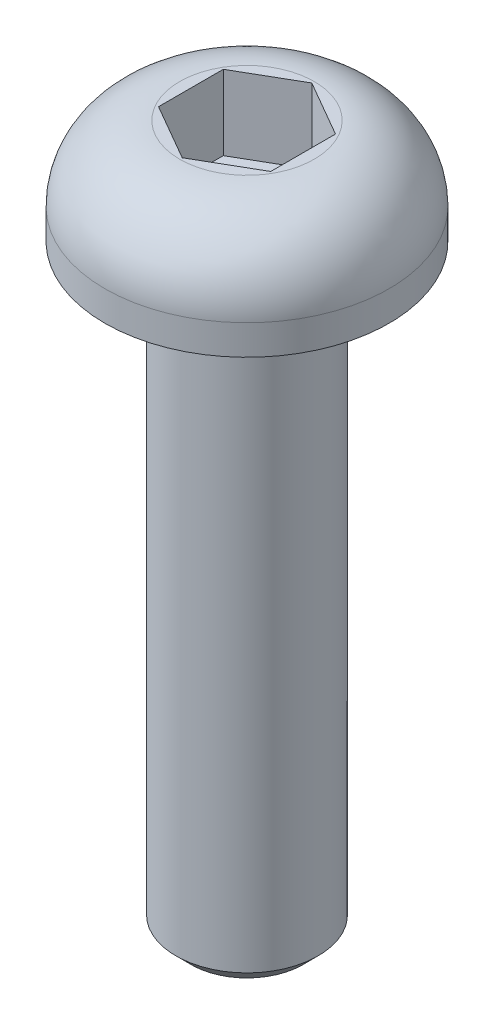
ISO-10303-21;
HEADER;
FILE_DESCRIPTION(('STEP AP214'),'2;1');
FILE_NAME('part.step','',(''),(''),'','','');
FILE_SCHEMA(('AUTOMOTIVE_DESIGN { 1 0 10303 214 1 1 1 1 }'));
ENDSEC;
DATA;
#1=APPLICATION_CONTEXT('core data for automotive mechanical design processes');
#2=APPLICATION_PROTOCOL_DEFINITION('international standard','automotive_design',2000,#1);
#3=PRODUCT_CONTEXT('',#1,'mechanical');
#4=PRODUCT('Part','Part','',(#3));
#5=PRODUCT_RELATED_PRODUCT_CATEGORY('part','',(#4));
#6=PRODUCT_DEFINITION_FORMATION('','',#4);
#7=PRODUCT_DEFINITION_CONTEXT('part definition',#1,'design');
#8=PRODUCT_DEFINITION('design','',#6,#7);
#9=PRODUCT_DEFINITION_SHAPE('','',#8);
#10=(LENGTH_UNIT() NAMED_UNIT(*) SI_UNIT(.MILLI.,.METRE.));
#11=(NAMED_UNIT(*) PLANE_ANGLE_UNIT() SI_UNIT($,.RADIAN.));
#12=(NAMED_UNIT(*) SI_UNIT($,.STERADIAN.) SOLID_ANGLE_UNIT());
#13=UNCERTAINTY_MEASURE_WITH_UNIT(LENGTH_MEASURE(1.E-05),#10,'distance_accuracy_value','');
#14=(GEOMETRIC_REPRESENTATION_CONTEXT(3) GLOBAL_UNCERTAINTY_ASSIGNED_CONTEXT((#13)) GLOBAL_UNIT_ASSIGNED_CONTEXT((#10,
#11,#12)) REPRESENTATION_CONTEXT('',''));
#15=CARTESIAN_POINT('',(0.,0.,0.));
#16=DIRECTION('',(0.,0.,1.));
#17=DIRECTION('',(1.,0.,0.));
#18=AXIS2_PLACEMENT_3D('',#15,#16,#17);
#19=CARTESIAN_POINT('',(0.,1.4,0.));
#20=DIRECTION('',(0.,-1.,0.));
#21=DIRECTION('',(0.,0.,-1.));
#22=AXIS2_PLACEMENT_3D('',#19,#20,#21);
#23=CYLINDRICAL_SURFACE('',#22,1.9);
#24=CARTESIAN_POINT('',(0.,0.4,0.));
#25=DIRECTION('',(0.,1.,0.));
#26=DIRECTION('',(0.,0.,1.));
#27=AXIS2_PLACEMENT_3D('',#24,#25,#26);
#28=CIRCLE('',#27,1.9);
#29=CARTESIAN_POINT('',(0.,0.4,1.9));
#30=VERTEX_POINT('',#29);
#31=EDGE_CURVE('E153',#30,#30,#28,.F.);
#32=ORIENTED_EDGE('',*,*,#31,.T.);
#33=EDGE_LOOP('',(#32));
#34=FACE_BOUND('',#33,.T.);
#35=CARTESIAN_POINT('',(0.,0.,0.));
#36=DIRECTION('',(0.,1.,0.));
#37=DIRECTION('',(0.,0.,1.));
#38=AXIS2_PLACEMENT_3D('',#35,#36,#37);
#39=CIRCLE('',#38,1.9);
#40=CARTESIAN_POINT('',(0.,0.,1.9));
#41=VERTEX_POINT('',#40);
#42=EDGE_CURVE('E142',#41,#41,#39,.T.);
#43=ORIENTED_EDGE('',*,*,#42,.T.);
#44=EDGE_LOOP('',(#43));
#45=FACE_BOUND('',#44,.T.);
#46=ADVANCED_FACE('F39',(#34,#45),#23,.T.);
#47=CARTESIAN_POINT('',(0.,1.4,0.));
#48=DIRECTION('',(0.,1.,0.));
#49=DIRECTION('',(0.,0.,1.));
#50=AXIS2_PLACEMENT_3D('',#47,#48,#49);
#51=PLANE('',#50);
#52=CARTESIAN_POINT('',(0.,1.4,0.));
#53=DIRECTION('',(0.,1.,0.));
#54=DIRECTION('',(0.,0.,1.));
#55=AXIS2_PLACEMENT_3D('',#52,#53,#54);
#56=CIRCLE('',#55,0.9);
#57=CARTESIAN_POINT('',(0.,1.4,0.9));
#58=VERTEX_POINT('',#57);
#59=EDGE_CURVE('E150',#58,#58,#56,.T.);
#60=ORIENTED_EDGE('',*,*,#59,.T.);
#61=EDGE_LOOP('',(#60));
#62=FACE_BOUND('',#61,.T.);
#63=DIRECTION('',(0.866025403784439,0.,0.5));
#64=VECTOR('',#63,1.);
#65=CARTESIAN_POINT('',(-0.75,1.4,0.433012701892219));
#66=LINE('',#65,#64);
#67=CARTESIAN_POINT('',(-0.75,1.4,0.433012701892219));
#68=VERTEX_POINT('',#67);
#69=CARTESIAN_POINT('',(0.,1.4,0.866025403784439));
#70=VERTEX_POINT('',#69);
#71=EDGE_CURVE('E55',#68,#70,#66,.T.);
#72=ORIENTED_EDGE('',*,*,#71,.F.);
#73=DIRECTION('',(0.,0.,1.));
#74=VECTOR('',#73,1.);
#75=CARTESIAN_POINT('',(-0.75,1.4,-0.43301270189222));
#76=LINE('',#75,#74);
#77=CARTESIAN_POINT('',(-0.75,1.4,-0.43301270189222));
#78=VERTEX_POINT('',#77);
#79=EDGE_CURVE('E138',#78,#68,#76,.T.);
#80=ORIENTED_EDGE('',*,*,#79,.F.);
#81=DIRECTION('',(-0.866025403784439,0.,0.5));
#82=VECTOR('',#81,1.);
#83=CARTESIAN_POINT('',(0.,1.4,-0.866025403784439));
#84=LINE('',#83,#82);
#85=CARTESIAN_POINT('',(0.,1.4,-0.866025403784439));
#86=VERTEX_POINT('',#85);
#87=EDGE_CURVE('E136',#86,#78,#84,.T.);
#88=ORIENTED_EDGE('',*,*,#87,.F.);
#89=DIRECTION('',(-0.866025403784439,0.,-0.5));
#90=VECTOR('',#89,1.);
#91=CARTESIAN_POINT('',(0.75,1.4,-0.43301270189222));
#92=LINE('',#91,#90);
#93=CARTESIAN_POINT('',(0.75,1.4,-0.43301270189222));
#94=VERTEX_POINT('',#93);
#95=EDGE_CURVE('E103',#94,#86,#92,.T.);
#96=ORIENTED_EDGE('',*,*,#95,.F.);
#97=DIRECTION('',(0.,0.,-1.));
#98=VECTOR('',#97,1.);
#99=CARTESIAN_POINT('',(0.75,1.4,0.43301270189222));
#100=LINE('',#99,#98);
#101=CARTESIAN_POINT('',(0.75,1.4,0.43301270189222));
#102=VERTEX_POINT('',#101);
#103=EDGE_CURVE('E132',#102,#94,#100,.T.);
#104=ORIENTED_EDGE('',*,*,#103,.F.);
#105=DIRECTION('',(0.866025403784439,0.,-0.5));
#106=VECTOR('',#105,1.);
#107=CARTESIAN_POINT('',(0.,1.4,0.866025403784439));
#108=LINE('',#107,#106);
#109=EDGE_CURVE('E129',#70,#102,#108,.T.);
#110=ORIENTED_EDGE('',*,*,#109,.F.);
#111=EDGE_LOOP('',(#72,#80,#88,#96,#104,#110));
#112=FACE_BOUND('',#111,.T.);
#113=ADVANCED_FACE('F171',(#62,#112),#51,.T.);
#114=CARTESIAN_POINT('',(0.,0.,0.));
#115=DIRECTION('',(0.,1.,0.));
#116=DIRECTION('',(0.,0.,1.));
#117=AXIS2_PLACEMENT_3D('',#114,#115,#116);
#118=PLANE('',#117);
#119=CARTESIAN_POINT('',(0.,0.,0.));
#120=DIRECTION('',(0.,-1.,0.));
#121=DIRECTION('',(0.,0.,-1.));
#122=AXIS2_PLACEMENT_3D('',#119,#120,#121);
#123=CIRCLE('',#122,0.95);
#124=CARTESIAN_POINT('',(0.,0.,-0.95));
#125=VERTEX_POINT('',#124);
#126=EDGE_CURVE('E155',#125,#125,#123,.T.);
#127=ORIENTED_EDGE('',*,*,#126,.F.);
#128=EDGE_LOOP('',(#127));
#129=FACE_BOUND('',#128,.T.);
#130=ORIENTED_EDGE('',*,*,#42,.F.);
#131=EDGE_LOOP('',(#130));
#132=FACE_BOUND('',#131,.T.);
#133=ADVANCED_FACE('F182',(#129,#132),#118,.F.);
#134=CARTESIAN_POINT('',(-0.75,0.4,0.433012701892219));
#135=DIRECTION('',(-0.5,0.,0.866025403784439));
#136=DIRECTION('',(0.866025403784439,0.,0.5));
#137=AXIS2_PLACEMENT_3D('',#134,#135,#136);
#138=PLANE('',#137);
#139=ORIENTED_EDGE('',*,*,#71,.T.);
#140=DIRECTION('',(0.,1.,0.));
#141=VECTOR('',#140,1.);
#142=CARTESIAN_POINT('',(0.,0.4,0.866025403784439));
#143=LINE('',#142,#141);
#144=CARTESIAN_POINT('',(0.,0.4,0.866025403784439));
#145=VERTEX_POINT('',#144);
#146=EDGE_CURVE('E85',#145,#70,#143,.T.);
#147=ORIENTED_EDGE('',*,*,#146,.F.);
#148=DIRECTION('',(0.866025403784439,0.,0.5));
#149=VECTOR('',#148,1.);
#150=CARTESIAN_POINT('',(-0.75,0.4,0.433012701892219));
#151=LINE('',#150,#149);
#152=CARTESIAN_POINT('',(-0.75,0.4,0.433012701892219));
#153=VERTEX_POINT('',#152);
#154=EDGE_CURVE('E140',#153,#145,#151,.T.);
#155=ORIENTED_EDGE('',*,*,#154,.F.);
#156=DIRECTION('',(0.,1.,0.));
#157=VECTOR('',#156,1.);
#158=CARTESIAN_POINT('',(-0.75,0.4,0.433012701892219));
#159=LINE('',#158,#157);
#160=EDGE_CURVE('E63',#153,#68,#159,.T.);
#161=ORIENTED_EDGE('',*,*,#160,.T.);
#162=EDGE_LOOP('',(#139,#147,#155,#161));
#163=FACE_BOUND('',#162,.T.);
#164=ADVANCED_FACE('F175',(#163),#138,.F.);
#165=CARTESIAN_POINT('',(-0.75,0.4,-0.43301270189222));
#166=DIRECTION('',(-1.,0.,0.));
#167=DIRECTION('',(0.,0.,1.));
#168=AXIS2_PLACEMENT_3D('',#165,#166,#167);
#169=PLANE('',#168);
#170=ORIENTED_EDGE('',*,*,#79,.T.);
#171=ORIENTED_EDGE('',*,*,#160,.F.);
#172=DIRECTION('',(0.,0.,1.));
#173=VECTOR('',#172,1.);
#174=CARTESIAN_POINT('',(-0.75,0.4,-0.43301270189222));
#175=LINE('',#174,#173);
#176=CARTESIAN_POINT('',(-0.75,0.4,-0.43301270189222));
#177=VERTEX_POINT('',#176);
#178=EDGE_CURVE('E115',#177,#153,#175,.T.);
#179=ORIENTED_EDGE('',*,*,#178,.F.);
#180=DIRECTION('',(0.,1.,0.));
#181=VECTOR('',#180,1.);
#182=CARTESIAN_POINT('',(-0.75,0.4,-0.43301270189222));
#183=LINE('',#182,#181);
#184=EDGE_CURVE('E107',#177,#78,#183,.T.);
#185=ORIENTED_EDGE('',*,*,#184,.T.);
#186=EDGE_LOOP('',(#170,#171,#179,#185));
#187=FACE_BOUND('',#186,.T.);
#188=ADVANCED_FACE('F173',(#187),#169,.F.);
#189=CARTESIAN_POINT('',(0.,0.4,-0.866025403784439));
#190=DIRECTION('',(-0.5,0.,-0.866025403784439));
#191=DIRECTION('',(-0.866025403784439,0.,0.5));
#192=AXIS2_PLACEMENT_3D('',#189,#190,#191);
#193=PLANE('',#192);
#194=ORIENTED_EDGE('',*,*,#87,.T.);
#195=ORIENTED_EDGE('',*,*,#184,.F.);
#196=DIRECTION('',(-0.866025403784439,0.,0.5));
#197=VECTOR('',#196,1.);
#198=CARTESIAN_POINT('',(0.,0.4,-0.866025403784439));
#199=LINE('',#198,#197);
#200=CARTESIAN_POINT('',(0.,0.4,-0.866025403784439));
#201=VERTEX_POINT('',#200);
#202=EDGE_CURVE('E111',#201,#177,#199,.T.);
#203=ORIENTED_EDGE('',*,*,#202,.F.);
#204=DIRECTION('',(0.,1.,0.));
#205=VECTOR('',#204,1.);
#206=CARTESIAN_POINT('',(0.,0.4,-0.866025403784439));
#207=LINE('',#206,#205);
#208=EDGE_CURVE('E96',#201,#86,#207,.T.);
#209=ORIENTED_EDGE('',*,*,#208,.T.);
#210=EDGE_LOOP('',(#194,#195,#203,#209));
#211=FACE_BOUND('',#210,.T.);
#212=ADVANCED_FACE('F112',(#211),#193,.F.);
#213=CARTESIAN_POINT('',(0.75,0.4,-0.43301270189222));
#214=DIRECTION('',(0.5,0.,-0.866025403784439));
#215=DIRECTION('',(-0.866025403784439,0.,-0.5));
#216=AXIS2_PLACEMENT_3D('',#213,#214,#215);
#217=PLANE('',#216);
#218=ORIENTED_EDGE('',*,*,#95,.T.);
#219=ORIENTED_EDGE('',*,*,#208,.F.);
#220=DIRECTION('',(-0.866025403784439,0.,-0.5));
#221=VECTOR('',#220,1.);
#222=CARTESIAN_POINT('',(0.75,0.4,-0.43301270189222));
#223=LINE('',#222,#221);
#224=CARTESIAN_POINT('',(0.75,0.4,-0.43301270189222));
#225=VERTEX_POINT('',#224);
#226=EDGE_CURVE('E100',#225,#201,#223,.T.);
#227=ORIENTED_EDGE('',*,*,#226,.F.);
#228=DIRECTION('',(0.,1.,0.));
#229=VECTOR('',#228,1.);
#230=CARTESIAN_POINT('',(0.75,0.4,-0.43301270189222));
#231=LINE('',#230,#229);
#232=EDGE_CURVE('E108',#225,#94,#231,.T.);
#233=ORIENTED_EDGE('',*,*,#232,.T.);
#234=EDGE_LOOP('',(#218,#219,#227,#233));
#235=FACE_BOUND('',#234,.T.);
#236=ADVANCED_FACE('F98',(#235),#217,.F.);
#237=CARTESIAN_POINT('',(0.75,0.4,0.43301270189222));
#238=DIRECTION('',(1.,0.,0.));
#239=DIRECTION('',(0.,0.,-1.));
#240=AXIS2_PLACEMENT_3D('',#237,#238,#239);
#241=PLANE('',#240);
#242=ORIENTED_EDGE('',*,*,#103,.T.);
#243=ORIENTED_EDGE('',*,*,#232,.F.);
#244=DIRECTION('',(0.,0.,-1.));
#245=VECTOR('',#244,1.);
#246=CARTESIAN_POINT('',(0.75,0.4,0.43301270189222));
#247=LINE('',#246,#245);
#248=CARTESIAN_POINT('',(0.75,0.4,0.43301270189222));
#249=VERTEX_POINT('',#248);
#250=EDGE_CURVE('E121',#249,#225,#247,.T.);
#251=ORIENTED_EDGE('',*,*,#250,.F.);
#252=DIRECTION('',(0.,1.,0.));
#253=VECTOR('',#252,1.);
#254=CARTESIAN_POINT('',(0.75,0.4,0.43301270189222));
#255=LINE('',#254,#253);
#256=EDGE_CURVE('E145',#249,#102,#255,.T.);
#257=ORIENTED_EDGE('',*,*,#256,.T.);
#258=EDGE_LOOP('',(#242,#243,#251,#257));
#259=FACE_BOUND('',#258,.T.);
#260=ADVANCED_FACE('F169',(#259),#241,.F.);
#261=CARTESIAN_POINT('',(0.,0.4,0.866025403784439));
#262=DIRECTION('',(0.5,0.,0.866025403784439));
#263=DIRECTION('',(0.866025403784439,0.,-0.5));
#264=AXIS2_PLACEMENT_3D('',#261,#262,#263);
#265=PLANE('',#264);
#266=ORIENTED_EDGE('',*,*,#109,.T.);
#267=ORIENTED_EDGE('',*,*,#256,.F.);
#268=DIRECTION('',(0.866025403784439,0.,-0.5));
#269=VECTOR('',#268,1.);
#270=CARTESIAN_POINT('',(0.,0.4,0.866025403784439));
#271=LINE('',#270,#269);
#272=EDGE_CURVE('E123',#145,#249,#271,.T.);
#273=ORIENTED_EDGE('',*,*,#272,.F.);
#274=ORIENTED_EDGE('',*,*,#146,.T.);
#275=EDGE_LOOP('',(#266,#267,#273,#274));
#276=FACE_BOUND('',#275,.T.);
#277=ADVANCED_FACE('F165',(#276),#265,.F.);
#278=CARTESIAN_POINT('',(0.,0.4,0.));
#279=DIRECTION('',(0.,1.,0.));
#280=DIRECTION('',(0.,0.,1.));
#281=AXIS2_PLACEMENT_3D('',#278,#279,#280);
#282=PLANE('',#281);
#283=ORIENTED_EDGE('',*,*,#154,.T.);
#284=ORIENTED_EDGE('',*,*,#272,.T.);
#285=ORIENTED_EDGE('',*,*,#250,.T.);
#286=ORIENTED_EDGE('',*,*,#226,.T.);
#287=ORIENTED_EDGE('',*,*,#202,.T.);
#288=ORIENTED_EDGE('',*,*,#178,.T.);
#289=EDGE_LOOP('',(#283,#284,#285,#286,#287,#288));
#290=FACE_BOUND('',#289,.T.);
#291=ADVANCED_FACE('F118',(#290),#282,.T.);
#292=CARTESIAN_POINT('',(0.,0.4,0.));
#293=DIRECTION('',(0.,1.,0.));
#294=DIRECTION('',(0.,0.,1.));
#295=AXIS2_PLACEMENT_3D('',#292,#293,#294);
#296=DEGENERATE_TOROIDAL_SURFACE('',#295,0.9,1.,.T.);
#297=ORIENTED_EDGE('',*,*,#31,.F.);
#298=EDGE_LOOP('',(#297));
#299=FACE_BOUND('',#298,.T.);
#300=ORIENTED_EDGE('',*,*,#59,.F.);
#301=EDGE_LOOP('',(#300));
#302=FACE_BOUND('',#301,.T.);
#303=ADVANCED_FACE('F195',(#299,#302),#296,.T.);
#304=CARTESIAN_POINT('',(0.,-8.,0.));
#305=DIRECTION('',(0.,1.,0.));
#306=DIRECTION('',(0.,0.,1.));
#307=AXIS2_PLACEMENT_3D('',#304,#305,#306);
#308=CYLINDRICAL_SURFACE('',#307,0.95);
#309=CARTESIAN_POINT('',(0.,-7.8,0.));
#310=DIRECTION('',(0.,-1.,0.));
#311=DIRECTION('',(0.,0.,-1.));
#312=AXIS2_PLACEMENT_3D('',#309,#310,#311);
#313=CIRCLE('',#312,0.95);
#314=CARTESIAN_POINT('',(0.,-7.8,-0.95));
#315=VERTEX_POINT('',#314);
#316=EDGE_CURVE('E11',#315,#315,#313,.F.);
#317=ORIENTED_EDGE('',*,*,#316,.T.);
#318=EDGE_LOOP('',(#317));
#319=FACE_BOUND('',#318,.T.);
#320=ORIENTED_EDGE('',*,*,#126,.T.);
#321=EDGE_LOOP('',(#320));
#322=FACE_BOUND('',#321,.T.);
#323=ADVANCED_FACE('F197',(#319,#322),#308,.T.);
#324=CARTESIAN_POINT('',(0.,-8.,0.));
#325=DIRECTION('',(0.,-1.,0.));
#326=DIRECTION('',(0.,0.,-1.));
#327=AXIS2_PLACEMENT_3D('',#324,#325,#326);
#328=PLANE('',#327);
#329=CARTESIAN_POINT('',(0.,-8.,0.));
#330=DIRECTION('',(0.,-1.,0.));
#331=DIRECTION('',(0.,0.,-1.));
#332=AXIS2_PLACEMENT_3D('',#329,#330,#331);
#333=CIRCLE('',#332,0.750000000000001);
#334=CARTESIAN_POINT('',(0.,-8.,-0.750000000000001));
#335=VERTEX_POINT('',#334);
#336=EDGE_CURVE('E48',#335,#335,#333,.T.);
#337=ORIENTED_EDGE('',*,*,#336,.T.);
#338=EDGE_LOOP('',(#337));
#339=FACE_BOUND('',#338,.T.);
#340=ADVANCED_FACE('F203',(#339),#328,.T.);
#341=CARTESIAN_POINT('',(0.,-8.,0.));
#342=DIRECTION('',(0.,1.,0.));
#343=DIRECTION('',(0.,0.,1.));
#344=AXIS2_PLACEMENT_3D('',#341,#342,#343);
#345=CONICAL_SURFACE('',#344,0.750000000000001,0.78539816339745);
#346=ORIENTED_EDGE('',*,*,#316,.F.);
#347=EDGE_LOOP('',(#346));
#348=FACE_BOUND('',#347,.T.);
#349=ORIENTED_EDGE('',*,*,#336,.F.);
#350=EDGE_LOOP('',(#349));
#351=FACE_BOUND('',#350,.T.);
#352=ADVANCED_FACE('F42',(#348,#351),#345,.T.);
#353=CLOSED_SHELL('',(#46,#113,#133,#164,#188,#212,#236,#260,#277,#291,#303,#323,#340,#352));
#354=MANIFOLD_SOLID_BREP('B2',#353);
#355=ADVANCED_BREP_SHAPE_REPRESENTATION('',(#18,#354),#14);
#356=SHAPE_DEFINITION_REPRESENTATION(#9,#355);
ENDSEC;
END-ISO-10303-21;
